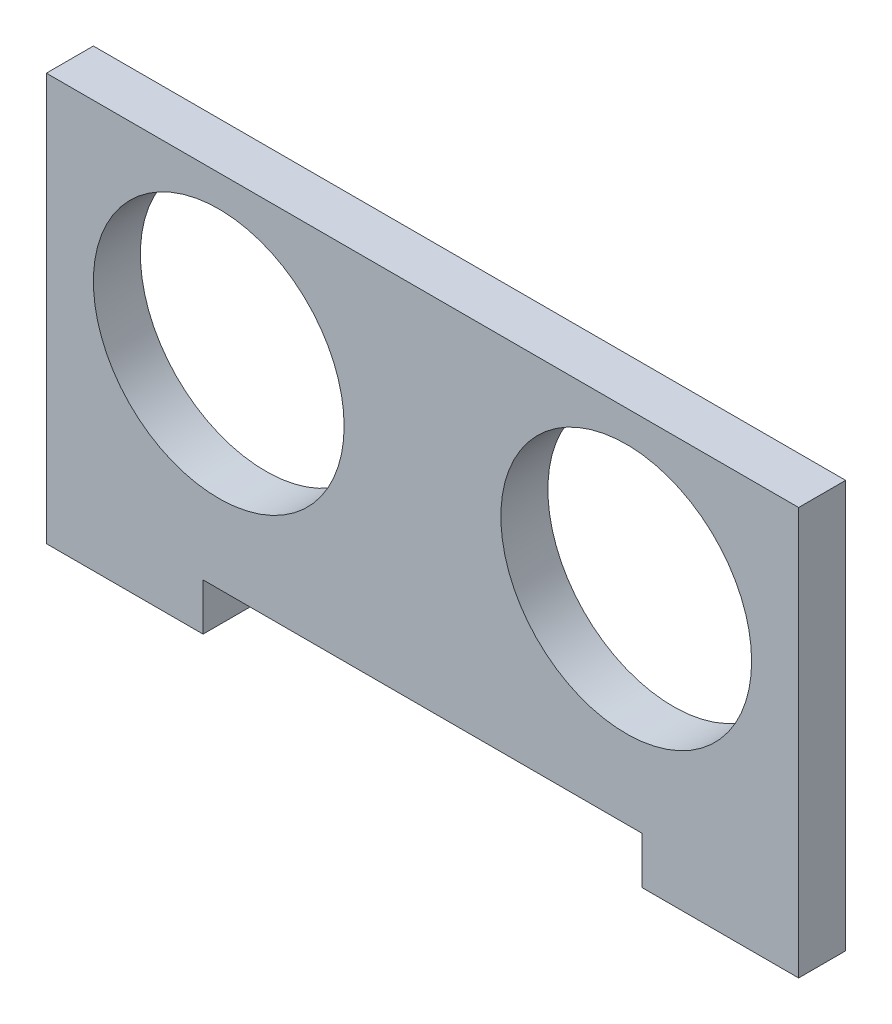
ISO-10303-21;
HEADER;
FILE_DESCRIPTION(('STEP AP214'),'2;1');
FILE_NAME('part.step','',(''),(''),'','','');
FILE_SCHEMA(('AUTOMOTIVE_DESIGN { 1 0 10303 214 1 1 1 1 }'));
ENDSEC;
DATA;
#1=APPLICATION_CONTEXT('core data for automotive mechanical design processes');
#2=APPLICATION_PROTOCOL_DEFINITION('international standard','automotive_design',2000,#1);
#3=PRODUCT_CONTEXT('',#1,'mechanical');
#4=PRODUCT('Part','Part','',(#3));
#5=PRODUCT_RELATED_PRODUCT_CATEGORY('part','',(#4));
#6=PRODUCT_DEFINITION_FORMATION('','',#4);
#7=PRODUCT_DEFINITION_CONTEXT('part definition',#1,'design');
#8=PRODUCT_DEFINITION('design','',#6,#7);
#9=PRODUCT_DEFINITION_SHAPE('','',#8);
#10=(LENGTH_UNIT() NAMED_UNIT(*) SI_UNIT(.MILLI.,.METRE.));
#11=(NAMED_UNIT(*) PLANE_ANGLE_UNIT() SI_UNIT($,.RADIAN.));
#12=(NAMED_UNIT(*) SI_UNIT($,.STERADIAN.) SOLID_ANGLE_UNIT());
#13=UNCERTAINTY_MEASURE_WITH_UNIT(LENGTH_MEASURE(1.E-05),#10,'distance_accuracy_value','');
#14=(GEOMETRIC_REPRESENTATION_CONTEXT(3) GLOBAL_UNCERTAINTY_ASSIGNED_CONTEXT((#13)) GLOBAL_UNIT_ASSIGNED_CONTEXT((#10,
#11,#12)) REPRESENTATION_CONTEXT('',''));
#15=CARTESIAN_POINT('',(0.,0.,0.));
#16=DIRECTION('',(0.,0.,1.));
#17=DIRECTION('',(1.,0.,0.));
#18=AXIS2_PLACEMENT_3D('',#15,#16,#17);
#19=CARTESIAN_POINT('',(0.,0.,3.));
#20=DIRECTION('',(0.,0.,1.));
#21=DIRECTION('',(1.,0.,0.));
#22=AXIS2_PLACEMENT_3D('',#19,#20,#21);
#23=PLANE('',#22);
#24=CARTESIAN_POINT('',(41.2,20.5000000000001,3.));
#25=DIRECTION('',(0.,0.,1.));
#26=DIRECTION('',(1.,0.,0.));
#27=AXIS2_PLACEMENT_3D('',#24,#25,#26);
#28=CIRCLE('',#27,8.);
#29=CARTESIAN_POINT('',(49.2,20.5000000000001,3.));
#30=VERTEX_POINT('',#29);
#31=EDGE_CURVE('E134',#30,#30,#28,.T.);
#32=ORIENTED_EDGE('',*,*,#31,.F.);
#33=EDGE_LOOP('',(#32));
#34=FACE_BOUND('',#33,.T.);
#35=DIRECTION('',(0.,-1.,0.));
#36=VECTOR('',#35,1.);
#37=CARTESIAN_POINT('',(42.1999999999999,4.50000000000005,3.));
#38=LINE('',#37,#36);
#39=CARTESIAN_POINT('',(42.2,7.50000000000005,3.));
#40=VERTEX_POINT('',#39);
#41=CARTESIAN_POINT('',(42.1999999999999,4.50000000000005,3.));
#42=VERTEX_POINT('',#41);
#43=EDGE_CURVE('E145',#40,#42,#38,.T.);
#44=ORIENTED_EDGE('',*,*,#43,.T.);
#45=DIRECTION('',(1.,0.,0.));
#46=VECTOR('',#45,1.);
#47=CARTESIAN_POINT('',(42.1999999999999,4.50000000000005,3.));
#48=LINE('',#47,#46);
#49=CARTESIAN_POINT('',(52.2,4.5,3.));
#50=VERTEX_POINT('',#49);
#51=EDGE_CURVE('E93',#42,#50,#48,.T.);
#52=ORIENTED_EDGE('',*,*,#51,.T.);
#53=DIRECTION('',(0.,1.,0.));
#54=VECTOR('',#53,1.);
#55=CARTESIAN_POINT('',(52.2,30.5,3.));
#56=LINE('',#55,#54);
#57=CARTESIAN_POINT('',(52.2,30.5,3.));
#58=VERTEX_POINT('',#57);
#59=EDGE_CURVE('E160',#50,#58,#56,.T.);
#60=ORIENTED_EDGE('',*,*,#59,.T.);
#61=DIRECTION('',(-1.,0.,0.));
#62=VECTOR('',#61,1.);
#63=CARTESIAN_POINT('',(4.19999999999997,30.5,3.));
#64=LINE('',#63,#62);
#65=CARTESIAN_POINT('',(4.19999999999997,30.5,3.));
#66=VERTEX_POINT('',#65);
#67=EDGE_CURVE('E173',#58,#66,#64,.T.);
#68=ORIENTED_EDGE('',*,*,#67,.T.);
#69=DIRECTION('',(0.,-1.,0.));
#70=VECTOR('',#69,1.);
#71=CARTESIAN_POINT('',(4.19999999999997,30.5,3.));
#72=LINE('',#71,#70);
#73=CARTESIAN_POINT('',(4.20000000000003,4.50000000000008,3.));
#74=VERTEX_POINT('',#73);
#75=EDGE_CURVE('E112',#66,#74,#72,.T.);
#76=ORIENTED_EDGE('',*,*,#75,.T.);
#77=DIRECTION('',(1.,0.,0.));
#78=VECTOR('',#77,1.);
#79=CARTESIAN_POINT('',(4.20000000000003,4.50000000000008,3.));
#80=LINE('',#79,#78);
#81=CARTESIAN_POINT('',(14.2,4.50000000000005,3.));
#82=VERTEX_POINT('',#81);
#83=EDGE_CURVE('E106',#74,#82,#80,.T.);
#84=ORIENTED_EDGE('',*,*,#83,.T.);
#85=DIRECTION('',(0.,1.,0.));
#86=VECTOR('',#85,1.);
#87=CARTESIAN_POINT('',(14.2,4.50000000000005,3.));
#88=LINE('',#87,#86);
#89=CARTESIAN_POINT('',(14.1999999999999,7.50000000000005,3.));
#90=VERTEX_POINT('',#89);
#91=EDGE_CURVE('E110',#82,#90,#88,.T.);
#92=ORIENTED_EDGE('',*,*,#91,.T.);
#93=DIRECTION('',(1.,0.,0.));
#94=VECTOR('',#93,1.);
#95=CARTESIAN_POINT('',(42.2,7.50000000000005,3.));
#96=LINE('',#95,#94);
#97=EDGE_CURVE('E50',#90,#40,#96,.T.);
#98=ORIENTED_EDGE('',*,*,#97,.T.);
#99=EDGE_LOOP('',(#44,#52,#60,#68,#76,#84,#92,#98));
#100=FACE_BOUND('',#99,.T.);
#101=CARTESIAN_POINT('',(15.2,20.5000000000001,3.));
#102=DIRECTION('',(0.,0.,1.));
#103=DIRECTION('',(1.,0.,0.));
#104=AXIS2_PLACEMENT_3D('',#101,#102,#103);
#105=CIRCLE('',#104,8.);
#106=CARTESIAN_POINT('',(23.2,20.5000000000001,3.));
#107=VERTEX_POINT('',#106);
#108=EDGE_CURVE('E182',#107,#107,#105,.T.);
#109=ORIENTED_EDGE('',*,*,#108,.F.);
#110=EDGE_LOOP('',(#109));
#111=FACE_BOUND('',#110,.T.);
#112=ADVANCED_FACE('F33',(#34,#100,#111),#23,.T.);
#113=CARTESIAN_POINT('',(0.,0.,0.));
#114=DIRECTION('',(0.,0.,1.));
#115=DIRECTION('',(1.,0.,0.));
#116=AXIS2_PLACEMENT_3D('',#113,#114,#115);
#117=PLANE('',#116);
#118=DIRECTION('',(0.,-1.,0.));
#119=VECTOR('',#118,1.);
#120=CARTESIAN_POINT('',(42.1999999999999,4.50000000000005,0.));
#121=LINE('',#120,#119);
#122=CARTESIAN_POINT('',(42.2,7.50000000000005,0.));
#123=VERTEX_POINT('',#122);
#124=CARTESIAN_POINT('',(42.1999999999999,4.50000000000005,0.));
#125=VERTEX_POINT('',#124);
#126=EDGE_CURVE('E130',#123,#125,#121,.T.);
#127=ORIENTED_EDGE('',*,*,#126,.F.);
#128=DIRECTION('',(1.,0.,0.));
#129=VECTOR('',#128,1.);
#130=CARTESIAN_POINT('',(42.2,7.50000000000005,0.));
#131=LINE('',#130,#129);
#132=CARTESIAN_POINT('',(14.1999999999999,7.50000000000005,0.));
#133=VERTEX_POINT('',#132);
#134=EDGE_CURVE('E85',#133,#123,#131,.T.);
#135=ORIENTED_EDGE('',*,*,#134,.F.);
#136=DIRECTION('',(0.,1.,0.));
#137=VECTOR('',#136,1.);
#138=CARTESIAN_POINT('',(14.2,4.50000000000005,0.));
#139=LINE('',#138,#137);
#140=CARTESIAN_POINT('',(14.2,4.50000000000005,0.));
#141=VERTEX_POINT('',#140);
#142=EDGE_CURVE('E79',#141,#133,#139,.T.);
#143=ORIENTED_EDGE('',*,*,#142,.F.);
#144=DIRECTION('',(1.,0.,0.));
#145=VECTOR('',#144,1.);
#146=CARTESIAN_POINT('',(4.20000000000003,4.50000000000008,0.));
#147=LINE('',#146,#145);
#148=CARTESIAN_POINT('',(4.20000000000003,4.50000000000008,0.));
#149=VERTEX_POINT('',#148);
#150=EDGE_CURVE('E120',#149,#141,#147,.T.);
#151=ORIENTED_EDGE('',*,*,#150,.F.);
#152=DIRECTION('',(0.,-1.,0.));
#153=VECTOR('',#152,1.);
#154=CARTESIAN_POINT('',(4.19999999999997,30.5,0.));
#155=LINE('',#154,#153);
#156=CARTESIAN_POINT('',(4.19999999999997,30.5,0.));
#157=VERTEX_POINT('',#156);
#158=EDGE_CURVE('E140',#157,#149,#155,.T.);
#159=ORIENTED_EDGE('',*,*,#158,.F.);
#160=DIRECTION('',(-1.,0.,0.));
#161=VECTOR('',#160,1.);
#162=CARTESIAN_POINT('',(4.19999999999997,30.5,0.));
#163=LINE('',#162,#161);
#164=CARTESIAN_POINT('',(52.2,30.5,0.));
#165=VERTEX_POINT('',#164);
#166=EDGE_CURVE('E138',#165,#157,#163,.T.);
#167=ORIENTED_EDGE('',*,*,#166,.F.);
#168=DIRECTION('',(0.,1.,0.));
#169=VECTOR('',#168,1.);
#170=CARTESIAN_POINT('',(52.2,30.5,0.));
#171=LINE('',#170,#169);
#172=CARTESIAN_POINT('',(52.2,4.5,0.));
#173=VERTEX_POINT('',#172);
#174=EDGE_CURVE('E136',#173,#165,#171,.T.);
#175=ORIENTED_EDGE('',*,*,#174,.F.);
#176=DIRECTION('',(1.,0.,0.));
#177=VECTOR('',#176,1.);
#178=CARTESIAN_POINT('',(42.1999999999999,4.50000000000005,0.));
#179=LINE('',#178,#177);
#180=EDGE_CURVE('E133',#125,#173,#179,.T.);
#181=ORIENTED_EDGE('',*,*,#180,.F.);
#182=EDGE_LOOP('',(#127,#135,#143,#151,#159,#167,#175,#181));
#183=FACE_BOUND('',#182,.T.);
#184=CARTESIAN_POINT('',(41.2,20.5000000000001,0.));
#185=DIRECTION('',(0.,0.,1.));
#186=DIRECTION('',(1.,0.,0.));
#187=AXIS2_PLACEMENT_3D('',#184,#185,#186);
#188=CIRCLE('',#187,8.);
#189=CARTESIAN_POINT('',(49.2,20.5000000000001,0.));
#190=VERTEX_POINT('',#189);
#191=EDGE_CURVE('E179',#190,#190,#188,.T.);
#192=ORIENTED_EDGE('',*,*,#191,.T.);
#193=EDGE_LOOP('',(#192));
#194=FACE_BOUND('',#193,.T.);
#195=CARTESIAN_POINT('',(15.2,20.5000000000001,0.));
#196=DIRECTION('',(0.,0.,1.));
#197=DIRECTION('',(1.,0.,0.));
#198=AXIS2_PLACEMENT_3D('',#195,#196,#197);
#199=CIRCLE('',#198,8.);
#200=CARTESIAN_POINT('',(23.2,20.5000000000001,0.));
#201=VERTEX_POINT('',#200);
#202=EDGE_CURVE('E185',#201,#201,#199,.T.);
#203=ORIENTED_EDGE('',*,*,#202,.T.);
#204=EDGE_LOOP('',(#203));
#205=FACE_BOUND('',#204,.T.);
#206=ADVANCED_FACE('F164',(#183,#194,#205),#117,.F.);
#207=CARTESIAN_POINT('',(42.1999999999999,4.50000000000005,3.));
#208=DIRECTION('',(1.,0.,0.));
#209=DIRECTION('',(0.,1.,0.));
#210=AXIS2_PLACEMENT_3D('',#207,#208,#209);
#211=PLANE('',#210);
#212=ORIENTED_EDGE('',*,*,#126,.T.);
#213=DIRECTION('',(0.,0.,-1.));
#214=VECTOR('',#213,1.);
#215=CARTESIAN_POINT('',(42.1999999999999,4.50000000000005,3.));
#216=LINE('',#215,#214);
#217=EDGE_CURVE('E11',#42,#125,#216,.T.);
#218=ORIENTED_EDGE('',*,*,#217,.F.);
#219=ORIENTED_EDGE('',*,*,#43,.F.);
#220=DIRECTION('',(0.,0.,-1.));
#221=VECTOR('',#220,1.);
#222=CARTESIAN_POINT('',(42.2,7.50000000000005,3.));
#223=LINE('',#222,#221);
#224=EDGE_CURVE('E126',#40,#123,#223,.T.);
#225=ORIENTED_EDGE('',*,*,#224,.T.);
#226=EDGE_LOOP('',(#212,#218,#219,#225));
#227=FACE_BOUND('',#226,.T.);
#228=ADVANCED_FACE('F35',(#227),#211,.F.);
#229=CARTESIAN_POINT('',(42.1999999999999,4.50000000000005,3.));
#230=DIRECTION('',(0.,1.,0.));
#231=DIRECTION('',(-1.,0.,0.));
#232=AXIS2_PLACEMENT_3D('',#229,#230,#231);
#233=PLANE('',#232);
#234=ORIENTED_EDGE('',*,*,#180,.T.);
#235=DIRECTION('',(0.,0.,-1.));
#236=VECTOR('',#235,1.);
#237=CARTESIAN_POINT('',(52.2,4.5,3.));
#238=LINE('',#237,#236);
#239=EDGE_CURVE('E42',#50,#173,#238,.T.);
#240=ORIENTED_EDGE('',*,*,#239,.F.);
#241=ORIENTED_EDGE('',*,*,#51,.F.);
#242=ORIENTED_EDGE('',*,*,#217,.T.);
#243=EDGE_LOOP('',(#234,#240,#241,#242));
#244=FACE_BOUND('',#243,.T.);
#245=ADVANCED_FACE('F217',(#244),#233,.F.);
#246=CARTESIAN_POINT('',(52.2,30.5,3.));
#247=DIRECTION('',(-1.,0.,0.));
#248=DIRECTION('',(0.,-1.,0.));
#249=AXIS2_PLACEMENT_3D('',#246,#247,#248);
#250=PLANE('',#249);
#251=ORIENTED_EDGE('',*,*,#174,.T.);
#252=DIRECTION('',(0.,0.,-1.));
#253=VECTOR('',#252,1.);
#254=CARTESIAN_POINT('',(52.2,30.5,3.));
#255=LINE('',#254,#253);
#256=EDGE_CURVE('E152',#58,#165,#255,.T.);
#257=ORIENTED_EDGE('',*,*,#256,.F.);
#258=ORIENTED_EDGE('',*,*,#59,.F.);
#259=ORIENTED_EDGE('',*,*,#239,.T.);
#260=EDGE_LOOP('',(#251,#257,#258,#259));
#261=FACE_BOUND('',#260,.T.);
#262=ADVANCED_FACE('F158',(#261),#250,.F.);
#263=CARTESIAN_POINT('',(4.19999999999997,30.5,3.));
#264=DIRECTION('',(0.,-1.,0.));
#265=DIRECTION('',(0.,0.,-1.));
#266=AXIS2_PLACEMENT_3D('',#263,#264,#265);
#267=PLANE('',#266);
#268=ORIENTED_EDGE('',*,*,#166,.T.);
#269=DIRECTION('',(0.,0.,-1.));
#270=VECTOR('',#269,1.);
#271=CARTESIAN_POINT('',(4.19999999999997,30.5,3.));
#272=LINE('',#271,#270);
#273=EDGE_CURVE('E149',#66,#157,#272,.T.);
#274=ORIENTED_EDGE('',*,*,#273,.F.);
#275=ORIENTED_EDGE('',*,*,#67,.F.);
#276=ORIENTED_EDGE('',*,*,#256,.T.);
#277=EDGE_LOOP('',(#268,#274,#275,#276));
#278=FACE_BOUND('',#277,.T.);
#279=ADVANCED_FACE('F169',(#278),#267,.F.);
#280=CARTESIAN_POINT('',(4.19999999999997,30.5,3.));
#281=DIRECTION('',(1.,0.,0.));
#282=DIRECTION('',(0.,1.,0.));
#283=AXIS2_PLACEMENT_3D('',#280,#281,#282);
#284=PLANE('',#283);
#285=ORIENTED_EDGE('',*,*,#158,.T.);
#286=DIRECTION('',(0.,0.,-1.));
#287=VECTOR('',#286,1.);
#288=CARTESIAN_POINT('',(4.20000000000003,4.50000000000008,3.));
#289=LINE('',#288,#287);
#290=EDGE_CURVE('E121',#74,#149,#289,.T.);
#291=ORIENTED_EDGE('',*,*,#290,.F.);
#292=ORIENTED_EDGE('',*,*,#75,.F.);
#293=ORIENTED_EDGE('',*,*,#273,.T.);
#294=EDGE_LOOP('',(#285,#291,#292,#293));
#295=FACE_BOUND('',#294,.T.);
#296=ADVANCED_FACE('F172',(#295),#284,.F.);
#297=CARTESIAN_POINT('',(4.20000000000003,4.50000000000008,3.));
#298=DIRECTION('',(0.,1.,0.));
#299=DIRECTION('',(-1.,0.,0.));
#300=AXIS2_PLACEMENT_3D('',#297,#298,#299);
#301=PLANE('',#300);
#302=ORIENTED_EDGE('',*,*,#150,.T.);
#303=DIRECTION('',(0.,0.,-1.));
#304=VECTOR('',#303,1.);
#305=CARTESIAN_POINT('',(14.2,4.50000000000005,3.));
#306=LINE('',#305,#304);
#307=EDGE_CURVE('E117',#82,#141,#306,.T.);
#308=ORIENTED_EDGE('',*,*,#307,.F.);
#309=ORIENTED_EDGE('',*,*,#83,.F.);
#310=ORIENTED_EDGE('',*,*,#290,.T.);
#311=EDGE_LOOP('',(#302,#308,#309,#310));
#312=FACE_BOUND('',#311,.T.);
#313=ADVANCED_FACE('F118',(#312),#301,.F.);
#314=CARTESIAN_POINT('',(14.2,4.50000000000005,3.));
#315=DIRECTION('',(-1.,0.,0.));
#316=DIRECTION('',(0.,-1.,0.));
#317=AXIS2_PLACEMENT_3D('',#314,#315,#316);
#318=PLANE('',#317);
#319=ORIENTED_EDGE('',*,*,#142,.T.);
#320=DIRECTION('',(0.,0.,-1.));
#321=VECTOR('',#320,1.);
#322=CARTESIAN_POINT('',(14.1999999999999,7.50000000000005,3.));
#323=LINE('',#322,#321);
#324=EDGE_CURVE('E122',#90,#133,#323,.T.);
#325=ORIENTED_EDGE('',*,*,#324,.F.);
#326=ORIENTED_EDGE('',*,*,#91,.F.);
#327=ORIENTED_EDGE('',*,*,#307,.T.);
#328=EDGE_LOOP('',(#319,#325,#326,#327));
#329=FACE_BOUND('',#328,.T.);
#330=ADVANCED_FACE('F124',(#329),#318,.F.);
#331=CARTESIAN_POINT('',(42.2,7.50000000000005,3.));
#332=DIRECTION('',(0.,1.,0.));
#333=DIRECTION('',(0.,0.,1.));
#334=AXIS2_PLACEMENT_3D('',#331,#332,#333);
#335=PLANE('',#334);
#336=ORIENTED_EDGE('',*,*,#134,.T.);
#337=ORIENTED_EDGE('',*,*,#224,.F.);
#338=ORIENTED_EDGE('',*,*,#97,.F.);
#339=ORIENTED_EDGE('',*,*,#324,.T.);
#340=EDGE_LOOP('',(#336,#337,#338,#339));
#341=FACE_BOUND('',#340,.T.);
#342=ADVANCED_FACE('F205',(#341),#335,.F.);
#343=CARTESIAN_POINT('',(41.2,20.5000000000001,3.));
#344=DIRECTION('',(0.,0.,-1.));
#345=DIRECTION('',(-1.,0.,0.));
#346=AXIS2_PLACEMENT_3D('',#343,#344,#345);
#347=CYLINDRICAL_SURFACE('',#346,8.);
#348=ORIENTED_EDGE('',*,*,#31,.T.);
#349=EDGE_LOOP('',(#348));
#350=FACE_BOUND('',#349,.T.);
#351=ORIENTED_EDGE('',*,*,#191,.F.);
#352=EDGE_LOOP('',(#351));
#353=FACE_BOUND('',#352,.T.);
#354=ADVANCED_FACE('F202',(#350,#353),#347,.F.);
#355=CARTESIAN_POINT('',(15.2,20.5000000000001,3.));
#356=DIRECTION('',(0.,0.,-1.));
#357=DIRECTION('',(-1.,0.,0.));
#358=AXIS2_PLACEMENT_3D('',#355,#356,#357);
#359=CYLINDRICAL_SURFACE('',#358,8.);
#360=ORIENTED_EDGE('',*,*,#108,.T.);
#361=EDGE_LOOP('',(#360));
#362=FACE_BOUND('',#361,.T.);
#363=ORIENTED_EDGE('',*,*,#202,.F.);
#364=EDGE_LOOP('',(#363));
#365=FACE_BOUND('',#364,.T.);
#366=ADVANCED_FACE('F191',(#362,#365),#359,.F.);
#367=CLOSED_SHELL('',(#112,#206,#228,#245,#262,#279,#296,#313,#330,#342,#354,#366));
#368=MANIFOLD_SOLID_BREP('B2',#367);
#369=ADVANCED_BREP_SHAPE_REPRESENTATION('',(#18,#368),#14);
#370=SHAPE_DEFINITION_REPRESENTATION(#9,#369);
ENDSEC;
END-ISO-10303-21;
